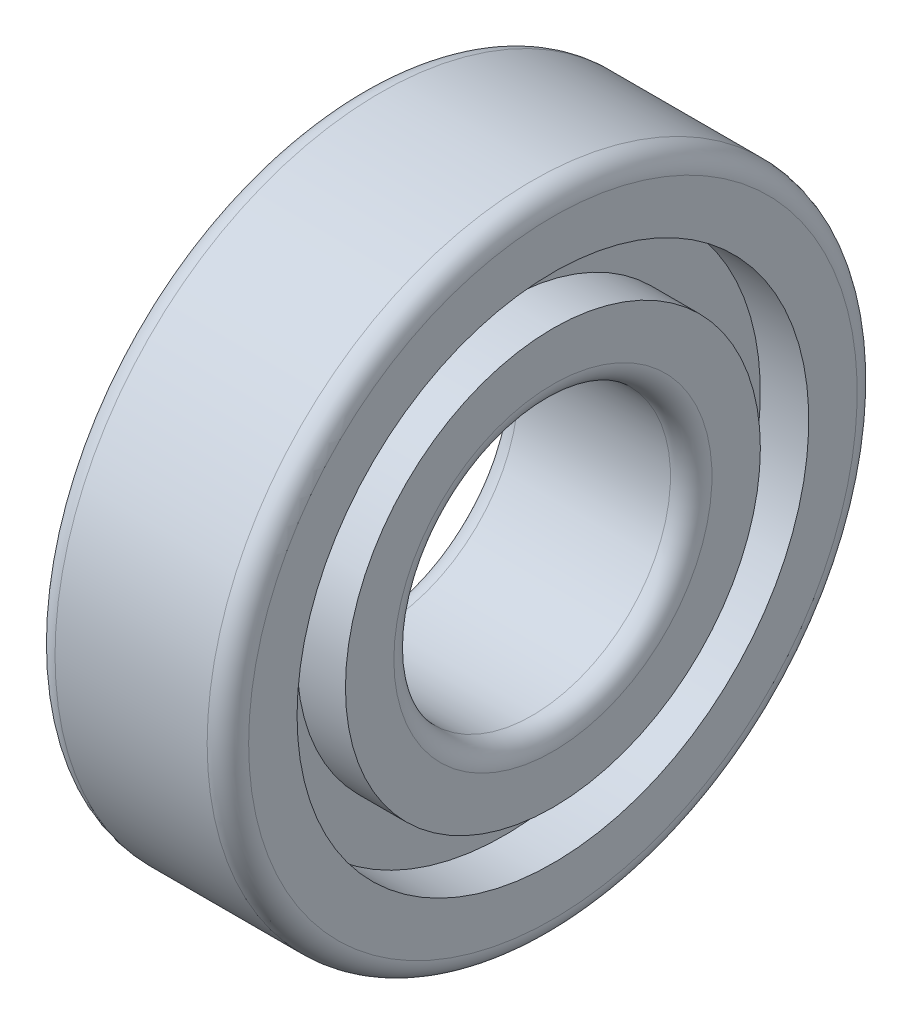
ISO-10303-21;
HEADER;
FILE_DESCRIPTION(('STEP AP214'),'2;1');
FILE_NAME('part.step','',(''),(''),'','','');
FILE_SCHEMA(('AUTOMOTIVE_DESIGN { 1 0 10303 214 1 1 1 1 }'));
ENDSEC;
DATA;
#1=APPLICATION_CONTEXT('core data for automotive mechanical design processes');
#2=APPLICATION_PROTOCOL_DEFINITION('international standard','automotive_design',2000,#1);
#3=PRODUCT_CONTEXT('',#1,'mechanical');
#4=PRODUCT('Part','Part','',(#3));
#5=PRODUCT_RELATED_PRODUCT_CATEGORY('part','',(#4));
#6=PRODUCT_DEFINITION_FORMATION('','',#4);
#7=PRODUCT_DEFINITION_CONTEXT('part definition',#1,'design');
#8=PRODUCT_DEFINITION('design','',#6,#7);
#9=PRODUCT_DEFINITION_SHAPE('','',#8);
#10=(LENGTH_UNIT() NAMED_UNIT(*) SI_UNIT(.MILLI.,.METRE.));
#11=(NAMED_UNIT(*) PLANE_ANGLE_UNIT() SI_UNIT($,.RADIAN.));
#12=(NAMED_UNIT(*) SI_UNIT($,.STERADIAN.) SOLID_ANGLE_UNIT());
#13=UNCERTAINTY_MEASURE_WITH_UNIT(LENGTH_MEASURE(1.E-05),#10,'distance_accuracy_value','');
#14=(GEOMETRIC_REPRESENTATION_CONTEXT(3) GLOBAL_UNCERTAINTY_ASSIGNED_CONTEXT((#13)) GLOBAL_UNIT_ASSIGNED_CONTEXT((#10,
#11,#12)) REPRESENTATION_CONTEXT('',''));
#15=CARTESIAN_POINT('',(0.,0.,0.));
#16=DIRECTION('',(0.,0.,1.));
#17=DIRECTION('',(1.,0.,0.));
#18=AXIS2_PLACEMENT_3D('',#15,#16,#17);
#19=CARTESIAN_POINT('',(-873.991742101089,0.,0.));
#20=DIRECTION('',(-1.,0.,0.));
#21=DIRECTION('',(0.,0.,1.));
#22=AXIS2_PLACEMENT_3D('',#19,#20,#21);
#23=CYLINDRICAL_SURFACE('',#22,15.);
#24=CARTESIAN_POINT('',(-7.00000000000001,0.,0.));
#25=DIRECTION('',(-1.,0.,0.));
#26=DIRECTION('',(0.,0.,1.));
#27=AXIS2_PLACEMENT_3D('',#24,#25,#26);
#28=CIRCLE('',#27,15.);
#29=CARTESIAN_POINT('',(-7.00000000000001,0.,15.));
#30=VERTEX_POINT('',#29);
#31=EDGE_CURVE('E85',#30,#30,#28,.T.);
#32=ORIENTED_EDGE('',*,*,#31,.F.);
#33=EDGE_LOOP('',(#32));
#34=FACE_BOUND('',#33,.T.);
#35=CARTESIAN_POINT('',(-3.49999999999995,0.,0.));
#36=DIRECTION('',(-1.,0.,0.));
#37=DIRECTION('',(0.,0.,1.));
#38=AXIS2_PLACEMENT_3D('',#35,#36,#37);
#39=CIRCLE('',#38,15.);
#40=CARTESIAN_POINT('',(-3.49999999999995,0.,15.));
#41=VERTEX_POINT('',#40);
#42=EDGE_CURVE('E10',#41,#41,#39,.T.);
#43=ORIENTED_EDGE('',*,*,#42,.T.);
#44=EDGE_LOOP('',(#43));
#45=FACE_BOUND('',#44,.T.);
#46=ADVANCED_FACE('F33',(#34,#45),#23,.T.);
#47=CARTESIAN_POINT('',(-3.5,15.,0.));
#48=DIRECTION('',(1.,0.,0.));
#49=DIRECTION('',(0.,0.,-1.));
#50=AXIS2_PLACEMENT_3D('',#47,#48,#49);
#51=PLANE('',#50);
#52=ORIENTED_EDGE('',*,*,#42,.F.);
#53=EDGE_LOOP('',(#52));
#54=FACE_BOUND('',#53,.T.);
#55=CARTESIAN_POINT('',(-3.49999999999995,0.,0.));
#56=DIRECTION('',(-1.,0.,0.));
#57=DIRECTION('',(0.,0.,1.));
#58=AXIS2_PLACEMENT_3D('',#55,#56,#57);
#59=CIRCLE('',#58,18.5);
#60=CARTESIAN_POINT('',(-3.49999999999995,0.,18.5));
#61=VERTEX_POINT('',#60);
#62=EDGE_CURVE('E39',#61,#61,#59,.T.);
#63=ORIENTED_EDGE('',*,*,#62,.T.);
#64=EDGE_LOOP('',(#63));
#65=FACE_BOUND('',#64,.T.);
#66=ADVANCED_FACE('F92',(#54,#65),#51,.F.);
#67=CARTESIAN_POINT('',(-873.991742101089,0.,0.));
#68=DIRECTION('',(-1.,0.,0.));
#69=DIRECTION('',(0.,0.,1.));
#70=AXIS2_PLACEMENT_3D('',#67,#68,#69);
#71=CYLINDRICAL_SURFACE('',#70,18.5);
#72=ORIENTED_EDGE('',*,*,#62,.F.);
#73=EDGE_LOOP('',(#72));
#74=FACE_BOUND('',#73,.T.);
#75=CARTESIAN_POINT('',(-7.00000000000001,0.,0.));
#76=DIRECTION('',(-1.,0.,0.));
#77=DIRECTION('',(0.,0.,1.));
#78=AXIS2_PLACEMENT_3D('',#75,#76,#77);
#79=CIRCLE('',#78,18.5);
#80=CARTESIAN_POINT('',(-7.00000000000001,0.,18.5));
#81=VERTEX_POINT('',#80);
#82=EDGE_CURVE('E43',#81,#81,#79,.T.);
#83=ORIENTED_EDGE('',*,*,#82,.T.);
#84=EDGE_LOOP('',(#83));
#85=FACE_BOUND('',#84,.T.);
#86=ADVANCED_FACE('F96',(#74,#85),#71,.F.);
#87=CARTESIAN_POINT('',(-7.,18.5,0.));
#88=DIRECTION('',(1.,0.,0.));
#89=DIRECTION('',(0.,0.,-1.));
#90=AXIS2_PLACEMENT_3D('',#87,#88,#89);
#91=PLANE('',#90);
#92=ORIENTED_EDGE('',*,*,#82,.F.);
#93=EDGE_LOOP('',(#92));
#94=FACE_BOUND('',#93,.T.);
#95=CARTESIAN_POINT('',(-7.00000000000001,0.,0.));
#96=DIRECTION('',(-1.,0.,0.));
#97=DIRECTION('',(0.,0.,1.));
#98=AXIS2_PLACEMENT_3D('',#95,#96,#97);
#99=CIRCLE('',#98,22.);
#100=CARTESIAN_POINT('',(-7.00000000000001,0.,22.));
#101=VERTEX_POINT('',#100);
#102=EDGE_CURVE('E47',#101,#101,#99,.T.);
#103=ORIENTED_EDGE('',*,*,#102,.T.);
#104=EDGE_LOOP('',(#103));
#105=FACE_BOUND('',#104,.T.);
#106=ADVANCED_FACE('F101',(#94,#105),#91,.F.);
#107=CARTESIAN_POINT('',(-5.5,0.,0.));
#108=DIRECTION('',(-1.,0.,0.));
#109=DIRECTION('',(0.,0.,1.));
#110=AXIS2_PLACEMENT_3D('',#107,#108,#109);
#111=TOROIDAL_SURFACE('',#110,22.,1.5);
#112=ORIENTED_EDGE('',*,*,#102,.F.);
#113=EDGE_LOOP('',(#112));
#114=FACE_BOUND('',#113,.T.);
#115=CARTESIAN_POINT('',(-5.49999999999995,0.,0.));
#116=DIRECTION('',(-1.,0.,0.));
#117=DIRECTION('',(0.,0.,1.));
#118=AXIS2_PLACEMENT_3D('',#115,#116,#117);
#119=CIRCLE('',#118,23.5);
#120=CARTESIAN_POINT('',(-5.49999999999995,0.,23.5));
#121=VERTEX_POINT('',#120);
#122=EDGE_CURVE('E52',#121,#121,#119,.T.);
#123=ORIENTED_EDGE('',*,*,#122,.T.);
#124=EDGE_LOOP('',(#123));
#125=FACE_BOUND('',#124,.T.);
#126=ADVANCED_FACE('F107',(#114,#125),#111,.T.);
#127=CARTESIAN_POINT('',(-873.991742101089,0.,0.));
#128=DIRECTION('',(-1.,0.,0.));
#129=DIRECTION('',(0.,0.,1.));
#130=AXIS2_PLACEMENT_3D('',#127,#128,#129);
#131=CYLINDRICAL_SURFACE('',#130,23.5);
#132=ORIENTED_EDGE('',*,*,#122,.F.);
#133=EDGE_LOOP('',(#132));
#134=FACE_BOUND('',#133,.T.);
#135=CARTESIAN_POINT('',(5.49999999999995,0.,0.));
#136=DIRECTION('',(-1.,0.,0.));
#137=DIRECTION('',(0.,0.,1.));
#138=AXIS2_PLACEMENT_3D('',#135,#136,#137);
#139=CIRCLE('',#138,23.5);
#140=CARTESIAN_POINT('',(5.49999999999995,0.,23.5));
#141=VERTEX_POINT('',#140);
#142=EDGE_CURVE('E55',#141,#141,#139,.T.);
#143=ORIENTED_EDGE('',*,*,#142,.T.);
#144=EDGE_LOOP('',(#143));
#145=FACE_BOUND('',#144,.T.);
#146=ADVANCED_FACE('F111',(#134,#145),#131,.T.);
#147=CARTESIAN_POINT('',(5.5,0.,0.));
#148=DIRECTION('',(-1.,0.,0.));
#149=DIRECTION('',(0.,0.,1.));
#150=AXIS2_PLACEMENT_3D('',#147,#148,#149);
#151=TOROIDAL_SURFACE('',#150,22.,1.5);
#152=ORIENTED_EDGE('',*,*,#142,.F.);
#153=EDGE_LOOP('',(#152));
#154=FACE_BOUND('',#153,.T.);
#155=CARTESIAN_POINT('',(7.00000000000001,0.,0.));
#156=DIRECTION('',(-1.,0.,0.));
#157=DIRECTION('',(0.,0.,1.));
#158=AXIS2_PLACEMENT_3D('',#155,#156,#157);
#159=CIRCLE('',#158,22.);
#160=CARTESIAN_POINT('',(7.00000000000001,0.,22.));
#161=VERTEX_POINT('',#160);
#162=EDGE_CURVE('E58',#161,#161,#159,.T.);
#163=ORIENTED_EDGE('',*,*,#162,.T.);
#164=EDGE_LOOP('',(#163));
#165=FACE_BOUND('',#164,.T.);
#166=ADVANCED_FACE('F115',(#154,#165),#151,.T.);
#167=CARTESIAN_POINT('',(7.,18.5,0.));
#168=DIRECTION('',(-1.,0.,0.));
#169=DIRECTION('',(0.,0.,1.));
#170=AXIS2_PLACEMENT_3D('',#167,#168,#169);
#171=PLANE('',#170);
#172=ORIENTED_EDGE('',*,*,#162,.F.);
#173=EDGE_LOOP('',(#172));
#174=FACE_BOUND('',#173,.T.);
#175=CARTESIAN_POINT('',(7.00000000000001,0.,0.));
#176=DIRECTION('',(-1.,0.,0.));
#177=DIRECTION('',(0.,0.,1.));
#178=AXIS2_PLACEMENT_3D('',#175,#176,#177);
#179=CIRCLE('',#178,18.5);
#180=CARTESIAN_POINT('',(7.00000000000001,0.,18.5));
#181=VERTEX_POINT('',#180);
#182=EDGE_CURVE('E61',#181,#181,#179,.T.);
#183=ORIENTED_EDGE('',*,*,#182,.T.);
#184=EDGE_LOOP('',(#183));
#185=FACE_BOUND('',#184,.T.);
#186=ADVANCED_FACE('F119',(#174,#185),#171,.F.);
#187=CARTESIAN_POINT('',(-873.991742101089,0.,0.));
#188=DIRECTION('',(-1.,0.,0.));
#189=DIRECTION('',(0.,0.,1.));
#190=AXIS2_PLACEMENT_3D('',#187,#188,#189);
#191=CYLINDRICAL_SURFACE('',#190,18.5);
#192=ORIENTED_EDGE('',*,*,#182,.F.);
#193=EDGE_LOOP('',(#192));
#194=FACE_BOUND('',#193,.T.);
#195=CARTESIAN_POINT('',(3.49999999999995,0.,0.));
#196=DIRECTION('',(-1.,0.,0.));
#197=DIRECTION('',(0.,0.,1.));
#198=AXIS2_PLACEMENT_3D('',#195,#196,#197);
#199=CIRCLE('',#198,18.5);
#200=CARTESIAN_POINT('',(3.49999999999995,0.,18.5));
#201=VERTEX_POINT('',#200);
#202=EDGE_CURVE('E64',#201,#201,#199,.T.);
#203=ORIENTED_EDGE('',*,*,#202,.T.);
#204=EDGE_LOOP('',(#203));
#205=FACE_BOUND('',#204,.T.);
#206=ADVANCED_FACE('F123',(#194,#205),#191,.F.);
#207=CARTESIAN_POINT('',(3.5,15.,0.));
#208=DIRECTION('',(-1.,0.,0.));
#209=DIRECTION('',(0.,0.,1.));
#210=AXIS2_PLACEMENT_3D('',#207,#208,#209);
#211=PLANE('',#210);
#212=ORIENTED_EDGE('',*,*,#202,.F.);
#213=EDGE_LOOP('',(#212));
#214=FACE_BOUND('',#213,.T.);
#215=CARTESIAN_POINT('',(3.49999999999995,0.,0.));
#216=DIRECTION('',(-1.,0.,0.));
#217=DIRECTION('',(0.,0.,1.));
#218=AXIS2_PLACEMENT_3D('',#215,#216,#217);
#219=CIRCLE('',#218,15.);
#220=CARTESIAN_POINT('',(3.49999999999995,0.,15.));
#221=VERTEX_POINT('',#220);
#222=EDGE_CURVE('E67',#221,#221,#219,.T.);
#223=ORIENTED_EDGE('',*,*,#222,.T.);
#224=EDGE_LOOP('',(#223));
#225=FACE_BOUND('',#224,.T.);
#226=ADVANCED_FACE('F127',(#214,#225),#211,.F.);
#227=CARTESIAN_POINT('',(-873.991742101089,0.,0.));
#228=DIRECTION('',(-1.,0.,0.));
#229=DIRECTION('',(0.,0.,1.));
#230=AXIS2_PLACEMENT_3D('',#227,#228,#229);
#231=CYLINDRICAL_SURFACE('',#230,15.);
#232=ORIENTED_EDGE('',*,*,#222,.F.);
#233=EDGE_LOOP('',(#232));
#234=FACE_BOUND('',#233,.T.);
#235=CARTESIAN_POINT('',(7.00000000000001,0.,0.));
#236=DIRECTION('',(-1.,0.,0.));
#237=DIRECTION('',(0.,0.,1.));
#238=AXIS2_PLACEMENT_3D('',#235,#236,#237);
#239=CIRCLE('',#238,15.);
#240=CARTESIAN_POINT('',(7.00000000000001,0.,15.));
#241=VERTEX_POINT('',#240);
#242=EDGE_CURVE('E70',#241,#241,#239,.T.);
#243=ORIENTED_EDGE('',*,*,#242,.T.);
#244=EDGE_LOOP('',(#243));
#245=FACE_BOUND('',#244,.T.);
#246=ADVANCED_FACE('F131',(#234,#245),#231,.T.);
#247=CARTESIAN_POINT('',(7.,11.5,0.));
#248=DIRECTION('',(-1.,0.,0.));
#249=DIRECTION('',(0.,0.,1.));
#250=AXIS2_PLACEMENT_3D('',#247,#248,#249);
#251=PLANE('',#250);
#252=ORIENTED_EDGE('',*,*,#242,.F.);
#253=EDGE_LOOP('',(#252));
#254=FACE_BOUND('',#253,.T.);
#255=CARTESIAN_POINT('',(7.00000000000001,0.,0.));
#256=DIRECTION('',(-1.,0.,0.));
#257=DIRECTION('',(0.,0.,1.));
#258=AXIS2_PLACEMENT_3D('',#255,#256,#257);
#259=CIRCLE('',#258,11.5);
#260=CARTESIAN_POINT('',(7.00000000000001,0.,11.5));
#261=VERTEX_POINT('',#260);
#262=EDGE_CURVE('E73',#261,#261,#259,.T.);
#263=ORIENTED_EDGE('',*,*,#262,.T.);
#264=EDGE_LOOP('',(#263));
#265=FACE_BOUND('',#264,.T.);
#266=ADVANCED_FACE('F135',(#254,#265),#251,.F.);
#267=CARTESIAN_POINT('',(5.5,0.,0.));
#268=DIRECTION('',(-1.,0.,0.));
#269=DIRECTION('',(0.,0.,1.));
#270=AXIS2_PLACEMENT_3D('',#267,#268,#269);
#271=TOROIDAL_SURFACE('',#270,11.5,1.5);
#272=ORIENTED_EDGE('',*,*,#262,.F.);
#273=EDGE_LOOP('',(#272));
#274=FACE_BOUND('',#273,.T.);
#275=CARTESIAN_POINT('',(5.49999999999995,0.,0.));
#276=DIRECTION('',(-1.,0.,0.));
#277=DIRECTION('',(0.,0.,1.));
#278=AXIS2_PLACEMENT_3D('',#275,#276,#277);
#279=CIRCLE('',#278,10.);
#280=CARTESIAN_POINT('',(5.49999999999995,0.,10.));
#281=VERTEX_POINT('',#280);
#282=EDGE_CURVE('E76',#281,#281,#279,.T.);
#283=ORIENTED_EDGE('',*,*,#282,.T.);
#284=EDGE_LOOP('',(#283));
#285=FACE_BOUND('',#284,.T.);
#286=ADVANCED_FACE('F139',(#274,#285),#271,.T.);
#287=CARTESIAN_POINT('',(-873.991742101089,0.,0.));
#288=DIRECTION('',(-1.,0.,0.));
#289=DIRECTION('',(0.,0.,1.));
#290=AXIS2_PLACEMENT_3D('',#287,#288,#289);
#291=CYLINDRICAL_SURFACE('',#290,10.);
#292=ORIENTED_EDGE('',*,*,#282,.F.);
#293=EDGE_LOOP('',(#292));
#294=FACE_BOUND('',#293,.T.);
#295=CARTESIAN_POINT('',(-5.49999999999995,0.,0.));
#296=DIRECTION('',(-1.,0.,0.));
#297=DIRECTION('',(0.,0.,1.));
#298=AXIS2_PLACEMENT_3D('',#295,#296,#297);
#299=CIRCLE('',#298,10.);
#300=CARTESIAN_POINT('',(-5.49999999999995,0.,10.));
#301=VERTEX_POINT('',#300);
#302=EDGE_CURVE('E79',#301,#301,#299,.T.);
#303=ORIENTED_EDGE('',*,*,#302,.T.);
#304=EDGE_LOOP('',(#303));
#305=FACE_BOUND('',#304,.T.);
#306=ADVANCED_FACE('F143',(#294,#305),#291,.F.);
#307=CARTESIAN_POINT('',(-5.5,0.,0.));
#308=DIRECTION('',(-1.,0.,0.));
#309=DIRECTION('',(0.,0.,1.));
#310=AXIS2_PLACEMENT_3D('',#307,#308,#309);
#311=TOROIDAL_SURFACE('',#310,11.5,1.5);
#312=ORIENTED_EDGE('',*,*,#302,.F.);
#313=EDGE_LOOP('',(#312));
#314=FACE_BOUND('',#313,.T.);
#315=CARTESIAN_POINT('',(-7.00000000000001,0.,0.));
#316=DIRECTION('',(-1.,0.,0.));
#317=DIRECTION('',(0.,0.,1.));
#318=AXIS2_PLACEMENT_3D('',#315,#316,#317);
#319=CIRCLE('',#318,11.5);
#320=CARTESIAN_POINT('',(-7.00000000000001,0.,11.5));
#321=VERTEX_POINT('',#320);
#322=EDGE_CURVE('E82',#321,#321,#319,.T.);
#323=ORIENTED_EDGE('',*,*,#322,.T.);
#324=EDGE_LOOP('',(#323));
#325=FACE_BOUND('',#324,.T.);
#326=ADVANCED_FACE('F147',(#314,#325),#311,.T.);
#327=CARTESIAN_POINT('',(-7.,11.5,0.));
#328=DIRECTION('',(1.,0.,0.));
#329=DIRECTION('',(0.,0.,-1.));
#330=AXIS2_PLACEMENT_3D('',#327,#328,#329);
#331=PLANE('',#330);
#332=ORIENTED_EDGE('',*,*,#322,.F.);
#333=EDGE_LOOP('',(#332));
#334=FACE_BOUND('',#333,.T.);
#335=ORIENTED_EDGE('',*,*,#31,.T.);
#336=EDGE_LOOP('',(#335));
#337=FACE_BOUND('',#336,.T.);
#338=ADVANCED_FACE('F89',(#334,#337),#331,.F.);
#339=CLOSED_SHELL('',(#46,#66,#86,#106,#126,#146,#166,#186,#206,#226,#246,#266,#286,#306,#326,#338));
#340=MANIFOLD_SOLID_BREP('B2',#339);
#341=ADVANCED_BREP_SHAPE_REPRESENTATION('',(#18,#340),#14);
#342=SHAPE_DEFINITION_REPRESENTATION(#9,#341);
ENDSEC;
END-ISO-10303-21;
